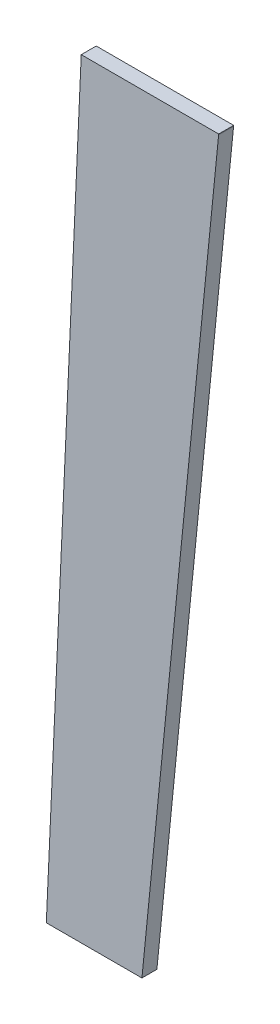
ISO-10303-21;
HEADER;
FILE_DESCRIPTION(('STEP AP214'),'2;1');
FILE_NAME('part.step','',(''),(''),'','','');
FILE_SCHEMA(('AUTOMOTIVE_DESIGN { 1 0 10303 214 1 1 1 1 }'));
ENDSEC;
DATA;
#1=APPLICATION_CONTEXT('core data for automotive mechanical design processes');
#2=APPLICATION_PROTOCOL_DEFINITION('international standard','automotive_design',2000,#1);
#3=PRODUCT_CONTEXT('',#1,'mechanical');
#4=PRODUCT('Part','Part','',(#3));
#5=PRODUCT_RELATED_PRODUCT_CATEGORY('part','',(#4));
#6=PRODUCT_DEFINITION_FORMATION('','',#4);
#7=PRODUCT_DEFINITION_CONTEXT('part definition',#1,'design');
#8=PRODUCT_DEFINITION('design','',#6,#7);
#9=PRODUCT_DEFINITION_SHAPE('','',#8);
#10=(LENGTH_UNIT() NAMED_UNIT(*) SI_UNIT(.MILLI.,.METRE.));
#11=(NAMED_UNIT(*) PLANE_ANGLE_UNIT() SI_UNIT($,.RADIAN.));
#12=(NAMED_UNIT(*) SI_UNIT($,.STERADIAN.) SOLID_ANGLE_UNIT());
#13=UNCERTAINTY_MEASURE_WITH_UNIT(LENGTH_MEASURE(1.E-05),#10,'distance_accuracy_value','');
#14=(GEOMETRIC_REPRESENTATION_CONTEXT(3) GLOBAL_UNCERTAINTY_ASSIGNED_CONTEXT((#13)) GLOBAL_UNIT_ASSIGNED_CONTEXT((#10,
#11,#12)) REPRESENTATION_CONTEXT('',''));
#15=CARTESIAN_POINT('',(0.,0.,0.));
#16=DIRECTION('',(0.,0.,1.));
#17=DIRECTION('',(1.,0.,0.));
#18=AXIS2_PLACEMENT_3D('',#15,#16,#17);
#19=CARTESIAN_POINT('',(97.3287520201356,-11.7992249327958,0.322232702988474));
#20=DIRECTION('',(0.995055569959869,-0.0993197497572401,0.));
#21=DIRECTION('',(0.0993197497572401,0.995055569959869,0.));
#22=AXIS2_PLACEMENT_3D('',#19,#20,#21);
#23=PLANE('',#22);
#24=DIRECTION('',(0.0993197497572401,0.995055569959869,0.));
#25=VECTOR('',#24,1.);
#26=CARTESIAN_POINT('',(97.3287520201356,-11.7992249327958,5.588));
#27=LINE('',#26,#25);
#28=CARTESIAN_POINT('',(97.3579733928344,-11.5064645327935,5.588));
#29=VERTEX_POINT('',#28);
#30=CARTESIAN_POINT('',(97.3293249882229,-11.793484532795,5.588));
#31=VERTEX_POINT('',#30);
#32=EDGE_CURVE('E77',#29,#31,#27,.F.);
#33=ORIENTED_EDGE('',*,*,#32,.T.);
#34=DIRECTION('',(0.,0.,1.));
#35=VECTOR('',#34,1.);
#36=CARTESIAN_POINT('',(97.3293249882179,-11.7934845327946,3.11150000000013));
#37=LINE('',#36,#35);
#38=CARTESIAN_POINT('',(97.3293249882228,-11.793484532795,0.635));
#39=VERTEX_POINT('',#38);
#40=EDGE_CURVE('E92',#31,#39,#37,.F.);
#41=ORIENTED_EDGE('',*,*,#40,.T.);
#42=DIRECTION('',(0.0993197497572395,0.995055569959869,0.));
#43=VECTOR('',#42,1.);
#44=CARTESIAN_POINT('',(97.3436491905317,-11.6499745327945,0.635));
#45=LINE('',#44,#43);
#46=CARTESIAN_POINT('',(97.3579733928344,-11.5064645327934,0.635));
#47=VERTEX_POINT('',#46);
#48=EDGE_CURVE('E109',#47,#39,#45,.F.);
#49=ORIENTED_EDGE('',*,*,#48,.F.);
#50=DIRECTION('',(0.,0.,-1.));
#51=VECTOR('',#50,1.);
#52=CARTESIAN_POINT('',(97.3579733928332,-11.5064645327935,3.11150000000013));
#53=LINE('',#52,#51);
#54=EDGE_CURVE('E90',#47,#29,#53,.F.);
#55=ORIENTED_EDGE('',*,*,#54,.T.);
#56=EDGE_LOOP('',(#33,#41,#49,#55));
#57=FACE_BOUND('',#56,.T.);
#58=ADVANCED_FACE('F17',(#57),#23,.T.);
#59=CARTESIAN_POINT('',(51.927419160194,-11.5007241328034,0.322232702988474));
#60=DIRECTION('',(-0.998970569791793,0.0453629881055097,0.));
#61=DIRECTION('',(-0.0453629881055097,-0.998970569791793,0.));
#62=AXIS2_PLACEMENT_3D('',#59,#60,#61);
#63=PLANE('',#62);
#64=DIRECTION('',(-0.0453629881055097,-0.998970569791793,0.));
#65=VECTOR('',#64,1.);
#66=CARTESIAN_POINT('',(51.927419160194,-11.5007241328034,5.588));
#67=LINE('',#66,#65);
#68=CARTESIAN_POINT('',(51.9141249882316,-11.793484532806,5.588));
#69=VERTEX_POINT('',#68);
#70=CARTESIAN_POINT('',(51.9271584901548,-11.5064645328032,5.588));
#71=VERTEX_POINT('',#70);
#72=EDGE_CURVE('E21',#69,#71,#67,.F.);
#73=ORIENTED_EDGE('',*,*,#72,.T.);
#74=DIRECTION('',(0.,0.,1.));
#75=VECTOR('',#74,1.);
#76=CARTESIAN_POINT('',(51.927158490154,-11.5064645328032,3.11150000000013));
#77=LINE('',#76,#75);
#78=CARTESIAN_POINT('',(51.9271584901548,-11.5064645328034,0.635));
#79=VERTEX_POINT('',#78);
#80=EDGE_CURVE('E73',#71,#79,#77,.F.);
#81=ORIENTED_EDGE('',*,*,#80,.T.);
#82=DIRECTION('',(-0.0453629881055329,-0.998970569791792,0.));
#83=VECTOR('',#82,1.);
#84=CARTESIAN_POINT('',(51.9206417391921,-11.6499745328047,0.635));
#85=LINE('',#84,#83);
#86=CARTESIAN_POINT('',(51.9141249882316,-11.793484532806,0.635));
#87=VERTEX_POINT('',#86);
#88=EDGE_CURVE('E78',#87,#79,#85,.F.);
#89=ORIENTED_EDGE('',*,*,#88,.F.);
#90=DIRECTION('',(0.,0.,-1.));
#91=VECTOR('',#90,1.);
#92=CARTESIAN_POINT('',(51.9141249882345,-11.7934845328062,3.11150000000013));
#93=LINE('',#92,#91);
#94=EDGE_CURVE('E76',#87,#69,#93,.F.);
#95=ORIENTED_EDGE('',*,*,#94,.T.);
#96=EDGE_LOOP('',(#73,#81,#89,#95));
#97=FACE_BOUND('',#96,.T.);
#98=ADVANCED_FACE('F72',(#97),#63,.T.);
#99=CARTESIAN_POINT('',(39.2404940622382,-270.879224935158,5.588));
#100=DIRECTION('',(0.,0.,1.));
#101=DIRECTION('',(1.,0.,0.));
#102=AXIS2_PLACEMENT_3D('',#99,#100,#101);
#103=PLANE('',#102);
#104=DIRECTION('',(1.,2.15041169670698E-13,0.));
#105=VECTOR('',#104,1.);
#106=CARTESIAN_POINT('',(74.6425659414936,-11.5064645327983,5.588));
#107=LINE('',#106,#105);
#108=EDGE_CURVE('E83',#29,#71,#107,.F.);
#109=ORIENTED_EDGE('',*,*,#108,.T.);
#110=ORIENTED_EDGE('',*,*,#72,.F.);
#111=DIRECTION('',(0.0453629881296856,0.998970569790695,0.));
#112=VECTOR('',#111,1.);
#113=CARTESIAN_POINT('',(50.6033581058195,-40.6588127083994,5.588));
#114=LINE('',#113,#112);
#115=CARTESIAN_POINT('',(49.2925912233966,-69.5241408839782,5.588));
#116=VERTEX_POINT('',#115);
#117=EDGE_CURVE('E104',#69,#116,#114,.F.);
#118=ORIENTED_EDGE('',*,*,#117,.T.);
#119=DIRECTION('',(0.0453629881297617,0.998970569790692,0.));
#120=VECTOR('',#119,1.);
#121=CARTESIAN_POINT('',(44.836321851942,-167.658812709492,5.588));
#122=LINE('',#121,#120);
#123=CARTESIAN_POINT('',(40.3800524804925,-265.793484535158,5.588));
#124=VERTEX_POINT('',#123);
#125=EDGE_CURVE('E103',#116,#124,#122,.F.);
#126=ORIENTED_EDGE('',*,*,#125,.T.);
#127=DIRECTION('',(-1.,0.,0.));
#128=VECTOR('',#127,1.);
#129=CARTESIAN_POINT('',(56.1784035113706,-265.793484535158,5.588));
#130=LINE('',#129,#128);
#131=CARTESIAN_POINT('',(71.9767545422362,-265.793484535158,5.588));
#132=VERTEX_POINT('',#131);
#133=EDGE_CURVE('E105',#124,#132,#130,.F.);
#134=ORIENTED_EDGE('',*,*,#133,.T.);
#135=DIRECTION('',(-0.0993197497436499,-0.995055569961225,0.));
#136=VECTOR('',#135,1.);
#137=CARTESIAN_POINT('',(84.6530397652227,-138.793484533953,5.588));
#138=LINE('',#137,#136);
#139=EDGE_CURVE('E98',#132,#31,#138,.F.);
#140=ORIENTED_EDGE('',*,*,#139,.T.);
#141=ORIENTED_EDGE('',*,*,#32,.F.);
#142=EDGE_LOOP('',(#109,#110,#118,#126,#134,#140,#141));
#143=FACE_BOUND('',#142,.T.);
#144=ADVANCED_FACE('F88',(#143),#103,.T.);
#145=CARTESIAN_POINT('',(71.4697031333076,-270.873484535158,0.322232702988474));
#146=DIRECTION('',(0.995055569961225,-0.0993197497436499,0.));
#147=DIRECTION('',(0.0993197497436499,0.995055569961225,0.));
#148=AXIS2_PLACEMENT_3D('',#145,#146,#147);
#149=PLANE('',#148);
#150=ORIENTED_EDGE('',*,*,#139,.F.);
#151=DIRECTION('',(0.,0.,1.));
#152=VECTOR('',#151,1.);
#153=CARTESIAN_POINT('',(71.9767545422406,-265.793484535158,3.11150000000013));
#154=LINE('',#153,#152);
#155=CARTESIAN_POINT('',(71.9767545422317,-265.793484535158,0.635));
#156=VERTEX_POINT('',#155);
#157=EDGE_CURVE('E110',#132,#156,#154,.F.);
#158=ORIENTED_EDGE('',*,*,#157,.T.);
#159=DIRECTION('',(0.0993197497436499,0.995055569961225,0.));
#160=VECTOR('',#159,1.);
#161=CARTESIAN_POINT('',(71.4697031333076,-270.873484535158,0.635));
#162=LINE('',#161,#160);
#163=EDGE_CURVE('E113',#156,#39,#162,.T.);
#164=ORIENTED_EDGE('',*,*,#163,.T.);
#165=ORIENTED_EDGE('',*,*,#40,.F.);
#166=EDGE_LOOP('',(#150,#158,#164,#165));
#167=FACE_BOUND('',#166,.T.);
#168=ADVANCED_FACE('F126',(#167),#149,.T.);
#169=CARTESIAN_POINT('',(98.2665896908878,-11.5064645327933,0.322232702988474));
#170=DIRECTION('',(-2.15041169670698E-13,1.,0.));
#171=DIRECTION('',(-1.,-2.15041169670698E-13,0.));
#172=AXIS2_PLACEMENT_3D('',#169,#170,#171);
#173=PLANE('',#172);
#174=ORIENTED_EDGE('',*,*,#108,.F.);
#175=ORIENTED_EDGE('',*,*,#54,.F.);
#176=DIRECTION('',(-1.,-2.10191312807367E-13,0.));
#177=VECTOR('',#176,1.);
#178=CARTESIAN_POINT('',(68.86901293663,-11.5064645327993,0.635));
#179=LINE('',#178,#177);
#180=EDGE_CURVE('E86',#47,#79,#179,.T.);
#181=ORIENTED_EDGE('',*,*,#180,.T.);
#182=ORIENTED_EDGE('',*,*,#80,.F.);
#183=EDGE_LOOP('',(#174,#175,#181,#182));
#184=FACE_BOUND('',#183,.T.);
#185=ADVANCED_FACE('F81',(#184),#173,.T.);
#186=CARTESIAN_POINT('',(51.9665556635312,-10.6388714057808,0.322232702988474));
#187=DIRECTION('',(-0.998970569790695,0.0453629881296857,0.));
#188=DIRECTION('',(-0.0453629881296857,-0.998970569790695,0.));
#189=AXIS2_PLACEMENT_3D('',#186,#187,#188);
#190=PLANE('',#189);
#191=ORIENTED_EDGE('',*,*,#117,.F.);
#192=ORIENTED_EDGE('',*,*,#94,.F.);
#193=DIRECTION('',(-0.0453629881296857,-0.998970569790695,0.));
#194=VECTOR('',#193,1.);
#195=CARTESIAN_POINT('',(51.9665556635312,-10.6388714057808,0.635));
#196=LINE('',#195,#194);
#197=CARTESIAN_POINT('',(49.2925912233957,-69.5241408839781,0.635));
#198=VERTEX_POINT('',#197);
#199=EDGE_CURVE('E117',#87,#198,#196,.T.);
#200=ORIENTED_EDGE('',*,*,#199,.T.);
#201=DIRECTION('',(0.,0.,-1.));
#202=VECTOR('',#201,1.);
#203=CARTESIAN_POINT('',(49.2925912233926,-69.524140883978,3.11150000000013));
#204=LINE('',#203,#202);
#205=EDGE_CURVE('E100',#198,#116,#204,.F.);
#206=ORIENTED_EDGE('',*,*,#205,.T.);
#207=EDGE_LOOP('',(#191,#192,#200,#206));
#208=FACE_BOUND('',#207,.T.);
#209=ADVANCED_FACE('F140',(#208),#190,.T.);
#210=CARTESIAN_POINT('',(49.4708419982502,-65.5987540109672,0.322232702988474));
#211=DIRECTION('',(-0.998970569790692,0.0453629881297617,0.));
#212=DIRECTION('',(-0.0453629881297617,-0.998970569790692,0.));
#213=AXIS2_PLACEMENT_3D('',#210,#211,#212);
#214=PLANE('',#213);
#215=ORIENTED_EDGE('',*,*,#125,.F.);
#216=ORIENTED_EDGE('',*,*,#205,.F.);
#217=DIRECTION('',(-0.0453629881297617,-0.998970569790692,0.));
#218=VECTOR('',#217,1.);
#219=CARTESIAN_POINT('',(49.4708419982502,-65.5987540109672,0.635));
#220=LINE('',#219,#218);
#221=CARTESIAN_POINT('',(40.3800524804925,-265.793484535158,0.635));
#222=VERTEX_POINT('',#221);
#223=EDGE_CURVE('E27',#198,#222,#220,.T.);
#224=ORIENTED_EDGE('',*,*,#223,.T.);
#225=DIRECTION('',(0.,0.,-1.));
#226=VECTOR('',#225,1.);
#227=CARTESIAN_POINT('',(40.3800524805006,-265.793484535158,3.11150000000013));
#228=LINE('',#227,#226);
#229=EDGE_CURVE('E35',#222,#124,#228,.F.);
#230=ORIENTED_EDGE('',*,*,#229,.T.);
#231=EDGE_LOOP('',(#215,#216,#224,#230));
#232=FACE_BOUND('',#231,.T.);
#233=ADVANCED_FACE('F138',(#232),#214,.T.);
#234=CARTESIAN_POINT('',(39.7481184392658,-265.793484535158,0.322232702988474));
#235=DIRECTION('',(0.,-1.,0.));
#236=DIRECTION('',(1.,0.,0.));
#237=AXIS2_PLACEMENT_3D('',#234,#235,#236);
#238=PLANE('',#237);
#239=ORIENTED_EDGE('',*,*,#133,.F.);
#240=ORIENTED_EDGE('',*,*,#229,.F.);
#241=DIRECTION('',(1.,0.,0.));
#242=VECTOR('',#241,1.);
#243=CARTESIAN_POINT('',(68.8690129366911,-265.793484535158,0.635));
#244=LINE('',#243,#242);
#245=EDGE_CURVE('E11',#222,#156,#244,.T.);
#246=ORIENTED_EDGE('',*,*,#245,.T.);
#247=ORIENTED_EDGE('',*,*,#157,.F.);
#248=EDGE_LOOP('',(#239,#240,#246,#247));
#249=FACE_BOUND('',#248,.T.);
#250=ADVANCED_FACE('F143',(#249),#238,.T.);
#251=CARTESIAN_POINT('',(39.2404940622382,-270.879224935158,0.635));
#252=DIRECTION('',(0.,0.,1.));
#253=DIRECTION('',(1.,0.,0.));
#254=AXIS2_PLACEMENT_3D('',#251,#252,#253);
#255=PLANE('',#254);
#256=ORIENTED_EDGE('',*,*,#223,.F.);
#257=ORIENTED_EDGE('',*,*,#199,.F.);
#258=ORIENTED_EDGE('',*,*,#88,.T.);
#259=ORIENTED_EDGE('',*,*,#180,.F.);
#260=ORIENTED_EDGE('',*,*,#48,.T.);
#261=ORIENTED_EDGE('',*,*,#163,.F.);
#262=ORIENTED_EDGE('',*,*,#245,.F.);
#263=EDGE_LOOP('',(#256,#257,#258,#259,#260,#261,#262));
#264=FACE_BOUND('',#263,.T.);
#265=ADVANCED_FACE('F19',(#264),#255,.F.);
#266=CLOSED_SHELL('',(#58,#98,#144,#168,#185,#209,#233,#250,#265));
#267=MANIFOLD_SOLID_BREP('B1',#266);
#268=ADVANCED_BREP_SHAPE_REPRESENTATION('',(#18,#267),#14);
#269=SHAPE_DEFINITION_REPRESENTATION(#9,#268);
ENDSEC;
END-ISO-10303-21;
